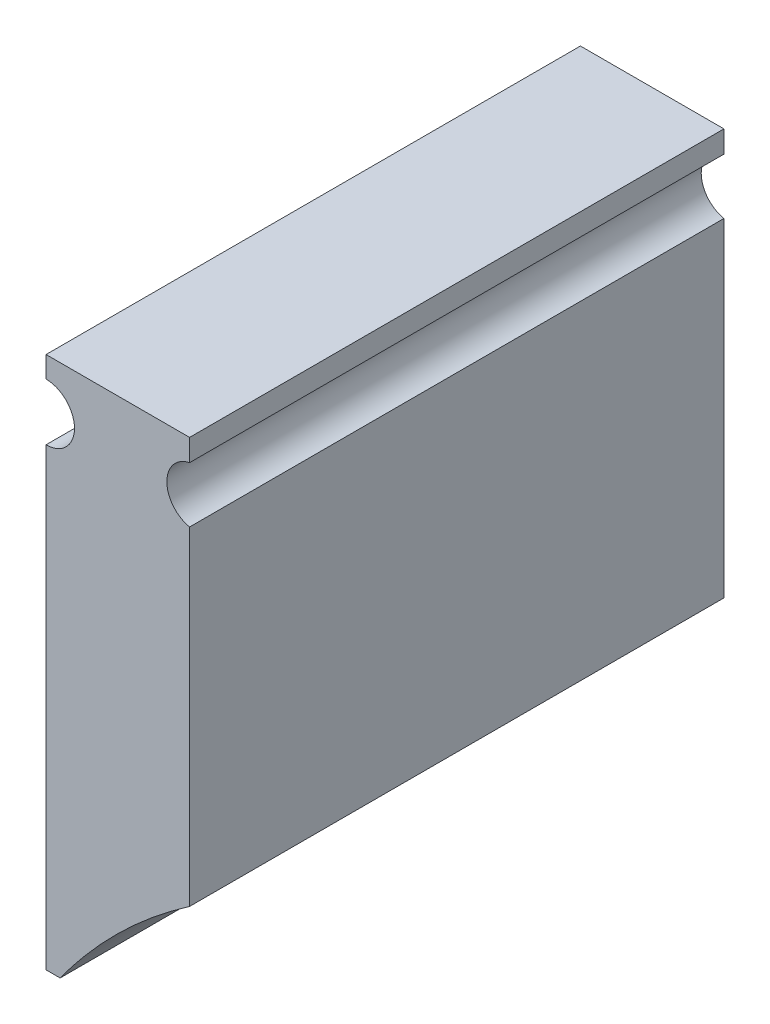
ISO-10303-21;
HEADER;
FILE_DESCRIPTION(('STEP AP214'),'2;1');
FILE_NAME('part.step','',(''),(''),'','','');
FILE_SCHEMA(('AUTOMOTIVE_DESIGN { 1 0 10303 214 1 1 1 1 }'));
ENDSEC;
DATA;
#1=APPLICATION_CONTEXT('core data for automotive mechanical design processes');
#2=APPLICATION_PROTOCOL_DEFINITION('international standard','automotive_design',2000,#1);
#3=PRODUCT_CONTEXT('',#1,'mechanical');
#4=PRODUCT('Part','Part','',(#3));
#5=PRODUCT_RELATED_PRODUCT_CATEGORY('part','',(#4));
#6=PRODUCT_DEFINITION_FORMATION('','',#4);
#7=PRODUCT_DEFINITION_CONTEXT('part definition',#1,'design');
#8=PRODUCT_DEFINITION('design','',#6,#7);
#9=PRODUCT_DEFINITION_SHAPE('','',#8);
#10=(LENGTH_UNIT() NAMED_UNIT(*) SI_UNIT(.MILLI.,.METRE.));
#11=(NAMED_UNIT(*) PLANE_ANGLE_UNIT() SI_UNIT($,.RADIAN.));
#12=(NAMED_UNIT(*) SI_UNIT($,.STERADIAN.) SOLID_ANGLE_UNIT());
#13=UNCERTAINTY_MEASURE_WITH_UNIT(LENGTH_MEASURE(1.E-05),#10,'distance_accuracy_value','');
#14=(GEOMETRIC_REPRESENTATION_CONTEXT(3) GLOBAL_UNCERTAINTY_ASSIGNED_CONTEXT((#13)) GLOBAL_UNIT_ASSIGNED_CONTEXT((#10,
#11,#12)) REPRESENTATION_CONTEXT('',''));
#15=CARTESIAN_POINT('',(0.,0.,0.));
#16=DIRECTION('',(0.,0.,1.));
#17=DIRECTION('',(1.,0.,0.));
#18=AXIS2_PLACEMENT_3D('',#15,#16,#17);
#19=CARTESIAN_POINT('',(2.4638,19.05,-19.304));
#20=DIRECTION('',(-1.,0.,0.));
#21=DIRECTION('',(0.,0.,1.));
#22=AXIS2_PLACEMENT_3D('',#19,#20,#21);
#23=PLANE('',#22);
#24=DIRECTION('',(0.,0.,1.));
#25=VECTOR('',#24,1.);
#26=CARTESIAN_POINT('',(2.4638,16.2765273685329,-19.304));
#27=LINE('',#26,#25);
#28=CARTESIAN_POINT('',(2.4638,16.2765273685329,-0.203199999999997));
#29=VERTEX_POINT('',#28);
#30=CARTESIAN_POINT('',(2.4638,16.2765273685329,-19.304));
#31=VERTEX_POINT('',#30);
#32=EDGE_CURVE('E47',#29,#31,#27,.F.);
#33=ORIENTED_EDGE('',*,*,#32,.F.);
#34=DIRECTION('',(0.,-1.,0.));
#35=VECTOR('',#34,1.);
#36=CARTESIAN_POINT('',(2.4638,19.05,-0.203199999999997));
#37=LINE('',#36,#35);
#38=CARTESIAN_POINT('',(2.4638,4.52925206053652,-0.203199999999997));
#39=VERTEX_POINT('',#38);
#40=EDGE_CURVE('E121',#29,#39,#37,.T.);
#41=ORIENTED_EDGE('',*,*,#40,.T.);
#42=DIRECTION('',(0.,0.,1.));
#43=VECTOR('',#42,1.);
#44=CARTESIAN_POINT('',(2.4638,4.52925206053652,-19.304));
#45=LINE('',#44,#43);
#46=CARTESIAN_POINT('',(2.4638,4.52925206053652,-19.304));
#47=VERTEX_POINT('',#46);
#48=EDGE_CURVE('E157',#47,#39,#45,.T.);
#49=ORIENTED_EDGE('',*,*,#48,.F.);
#50=DIRECTION('',(0.,-1.,0.));
#51=VECTOR('',#50,1.);
#52=CARTESIAN_POINT('',(2.4638,19.05,-19.304));
#53=LINE('',#52,#51);
#54=EDGE_CURVE('E122',#31,#47,#53,.T.);
#55=ORIENTED_EDGE('',*,*,#54,.F.);
#56=EDGE_LOOP('',(#33,#41,#49,#55));
#57=FACE_BOUND('',#56,.T.);
#58=ADVANCED_FACE('F33',(#57),#23,.F.);
#59=DIRECTION('',(0.,0.,1.));
#60=VECTOR('',#59,1.);
#61=CARTESIAN_POINT('',(2.4638,18.2674726314671,-19.304));
#62=LINE('',#61,#60);
#63=CARTESIAN_POINT('',(2.4638,18.2674726314671,-19.304));
#64=VERTEX_POINT('',#63);
#65=CARTESIAN_POINT('',(2.4638,18.2674726314671,-0.203199999999997));
#66=VERTEX_POINT('',#65);
#67=EDGE_CURVE('E102',#64,#66,#62,.T.);
#68=ORIENTED_EDGE('',*,*,#67,.F.);
#69=CARTESIAN_POINT('',(2.4638,19.05,-19.304));
#70=VERTEX_POINT('',#69);
#71=EDGE_CURVE('E112',#70,#64,#53,.T.);
#72=ORIENTED_EDGE('',*,*,#71,.F.);
#73=DIRECTION('',(0.,0.,-1.));
#74=VECTOR('',#73,1.);
#75=CARTESIAN_POINT('',(2.4638,19.05,-19.304));
#76=LINE('',#75,#74);
#77=CARTESIAN_POINT('',(2.4638,19.05,-0.203199999999997));
#78=VERTEX_POINT('',#77);
#79=EDGE_CURVE('E168',#78,#70,#76,.T.);
#80=ORIENTED_EDGE('',*,*,#79,.F.);
#81=EDGE_CURVE('E115',#78,#66,#37,.T.);
#82=ORIENTED_EDGE('',*,*,#81,.T.);
#83=EDGE_LOOP('',(#68,#72,#80,#82));
#84=FACE_BOUND('',#83,.T.);
#85=ADVANCED_FACE('F110',(#84),#23,.F.);
#86=CARTESIAN_POINT('',(-2.667,19.05,-19.304));
#87=DIRECTION('',(1.,0.,0.));
#88=DIRECTION('',(0.,0.,-1.));
#89=AXIS2_PLACEMENT_3D('',#86,#87,#88);
#90=PLANE('',#89);
#91=DIRECTION('',(0.,-1.,0.));
#92=VECTOR('',#91,1.);
#93=CARTESIAN_POINT('',(-2.667,19.05,-19.304));
#94=LINE('',#93,#92);
#95=CARTESIAN_POINT('',(-2.667,19.05,-19.304));
#96=VERTEX_POINT('',#95);
#97=CARTESIAN_POINT('',(-2.667,18.288,-19.304));
#98=VERTEX_POINT('',#97);
#99=EDGE_CURVE('E125',#96,#98,#94,.T.);
#100=ORIENTED_EDGE('',*,*,#99,.T.);
#101=DIRECTION('',(0.,0.,1.));
#102=VECTOR('',#101,1.);
#103=CARTESIAN_POINT('',(-2.667,18.288,-19.304));
#104=LINE('',#103,#102);
#105=CARTESIAN_POINT('',(-2.667,18.288,-0.203199999999997));
#106=VERTEX_POINT('',#105);
#107=EDGE_CURVE('E55',#98,#106,#104,.T.);
#108=ORIENTED_EDGE('',*,*,#107,.T.);
#109=DIRECTION('',(0.,-1.,0.));
#110=VECTOR('',#109,1.);
#111=CARTESIAN_POINT('',(-2.667,19.05,-0.203199999999997));
#112=LINE('',#111,#110);
#113=CARTESIAN_POINT('',(-2.667,19.05,-0.203199999999997));
#114=VERTEX_POINT('',#113);
#115=EDGE_CURVE('E41',#114,#106,#112,.T.);
#116=ORIENTED_EDGE('',*,*,#115,.F.);
#117=DIRECTION('',(0.,0.,1.));
#118=VECTOR('',#117,1.);
#119=CARTESIAN_POINT('',(-2.667,19.05,-19.304));
#120=LINE('',#119,#118);
#121=EDGE_CURVE('E161',#96,#114,#120,.T.);
#122=ORIENTED_EDGE('',*,*,#121,.F.);
#123=EDGE_LOOP('',(#100,#108,#116,#122));
#124=FACE_BOUND('',#123,.T.);
#125=ADVANCED_FACE('F175',(#124),#90,.F.);
#126=CARTESIAN_POINT('',(-2.667,16.256,-0.203199999999997));
#127=VERTEX_POINT('',#126);
#128=CARTESIAN_POINT('',(-2.667,0.,-0.203199999999997));
#129=VERTEX_POINT('',#128);
#130=EDGE_CURVE('E128',#127,#129,#112,.T.);
#131=ORIENTED_EDGE('',*,*,#130,.F.);
#132=DIRECTION('',(0.,0.,1.));
#133=VECTOR('',#132,1.);
#134=CARTESIAN_POINT('',(-2.667,16.256,-19.304));
#135=LINE('',#134,#133);
#136=CARTESIAN_POINT('',(-2.667,16.256,-19.304));
#137=VERTEX_POINT('',#136);
#138=EDGE_CURVE('E178',#137,#127,#135,.T.);
#139=ORIENTED_EDGE('',*,*,#138,.F.);
#140=CARTESIAN_POINT('',(-2.667,0.,-19.304));
#141=VERTEX_POINT('',#140);
#142=EDGE_CURVE('E153',#137,#141,#94,.T.);
#143=ORIENTED_EDGE('',*,*,#142,.T.);
#144=DIRECTION('',(0.,0.,1.));
#145=VECTOR('',#144,1.);
#146=CARTESIAN_POINT('',(-2.667,0.,-19.304));
#147=LINE('',#146,#145);
#148=EDGE_CURVE('E148',#141,#129,#147,.T.);
#149=ORIENTED_EDGE('',*,*,#148,.T.);
#150=EDGE_LOOP('',(#131,#139,#143,#149));
#151=FACE_BOUND('',#150,.T.);
#152=ADVANCED_FACE('F35',(#151),#90,.F.);
#153=CARTESIAN_POINT('',(-2.667,19.05,-0.203199999999997));
#154=DIRECTION('',(0.,0.,-1.));
#155=DIRECTION('',(-1.,0.,0.));
#156=AXIS2_PLACEMENT_3D('',#153,#154,#155);
#157=PLANE('',#156);
#158=CARTESIAN_POINT('',(2.667,17.272,-0.203199999999997));
#159=DIRECTION('',(0.,0.,-1.));
#160=DIRECTION('',(-1.,0.,0.));
#161=AXIS2_PLACEMENT_3D('',#158,#159,#160);
#162=CIRCLE('',#161,1.016);
#163=EDGE_CURVE('E116',#66,#29,#162,.F.);
#164=ORIENTED_EDGE('',*,*,#163,.F.);
#165=ORIENTED_EDGE('',*,*,#81,.F.);
#166=DIRECTION('',(1.,0.,0.));
#167=VECTOR('',#166,1.);
#168=CARTESIAN_POINT('',(-2.667,19.05,-0.203199999999997));
#169=LINE('',#168,#167);
#170=EDGE_CURVE('E164',#114,#78,#169,.T.);
#171=ORIENTED_EDGE('',*,*,#170,.F.);
#172=ORIENTED_EDGE('',*,*,#115,.T.);
#173=CARTESIAN_POINT('',(-2.667,17.272,-0.203199999999997));
#174=DIRECTION('',(0.,0.,-1.));
#175=DIRECTION('',(-1.,0.,0.));
#176=AXIS2_PLACEMENT_3D('',#173,#174,#175);
#177=CIRCLE('',#176,1.016);
#178=EDGE_CURVE('E139',#106,#127,#177,.T.);
#179=ORIENTED_EDGE('',*,*,#178,.T.);
#180=ORIENTED_EDGE('',*,*,#130,.T.);
#181=DIRECTION('',(1.,0.,0.));
#182=VECTOR('',#181,1.);
#183=CARTESIAN_POINT('',(-2.667,0.,-0.203199999999997));
#184=LINE('',#183,#182);
#185=CARTESIAN_POINT('',(-2.16420531257216,0.,-0.203199999999997));
#186=VERTEX_POINT('',#185);
#187=EDGE_CURVE('E138',#129,#186,#184,.T.);
#188=ORIENTED_EDGE('',*,*,#187,.T.);
#189=CARTESIAN_POINT('',(2.4638,4.52925206053652,-0.203199999999997));
#190=CARTESIAN_POINT('',(-0.235595224669027,2.66307700172279,-0.203199999999997));
#191=CARTESIAN_POINT('',(-2.16420531257216,0.,-0.203199999999997));
#192=B_SPLINE_CURVE_WITH_KNOTS('',2,(#189,#190,#191),.UNSPECIFIED.,.F.,.F.,(3,3),(0.,1.),.UNSPECIFIED.);
#193=EDGE_CURVE('E155',#186,#39,#192,.F.);
#194=ORIENTED_EDGE('',*,*,#193,.T.);
#195=ORIENTED_EDGE('',*,*,#40,.F.);
#196=EDGE_LOOP('',(#164,#165,#171,#172,#179,#180,#188,#194,#195));
#197=FACE_BOUND('',#196,.T.);
#198=ADVANCED_FACE('F136',(#197),#157,.F.);
#199=CARTESIAN_POINT('',(-2.667,19.05,-19.304));
#200=DIRECTION('',(0.,0.,1.));
#201=DIRECTION('',(1.,0.,0.));
#202=AXIS2_PLACEMENT_3D('',#199,#200,#201);
#203=PLANE('',#202);
#204=CARTESIAN_POINT('',(2.667,17.272,-19.304));
#205=DIRECTION('',(0.,0.,1.));
#206=DIRECTION('',(1.,0.,0.));
#207=AXIS2_PLACEMENT_3D('',#204,#205,#206);
#208=CIRCLE('',#207,1.016);
#209=EDGE_CURVE('E11',#31,#64,#208,.F.);
#210=ORIENTED_EDGE('',*,*,#209,.F.);
#211=ORIENTED_EDGE('',*,*,#54,.T.);
#212=CARTESIAN_POINT('',(2.4638,4.52925206053652,-19.304));
#213=CARTESIAN_POINT('',(-0.235595224669027,2.66307700172279,-19.304));
#214=CARTESIAN_POINT('',(-2.16420531257216,0.,-19.304));
#215=B_SPLINE_CURVE_WITH_KNOTS('',2,(#212,#213,#214),.UNSPECIFIED.,.F.,.F.,(3,3),(0.,1.),.UNSPECIFIED.);
#216=CARTESIAN_POINT('',(-2.16420531257216,0.,-19.304));
#217=VERTEX_POINT('',#216);
#218=EDGE_CURVE('E185',#47,#217,#215,.T.);
#219=ORIENTED_EDGE('',*,*,#218,.T.);
#220=DIRECTION('',(-1.,0.,0.));
#221=VECTOR('',#220,1.);
#222=CARTESIAN_POINT('',(-2.667,0.,-19.304));
#223=LINE('',#222,#221);
#224=EDGE_CURVE('E150',#217,#141,#223,.T.);
#225=ORIENTED_EDGE('',*,*,#224,.T.);
#226=ORIENTED_EDGE('',*,*,#142,.F.);
#227=CARTESIAN_POINT('',(-2.667,17.272,-19.304));
#228=DIRECTION('',(0.,0.,1.));
#229=DIRECTION('',(-1.,0.,0.));
#230=AXIS2_PLACEMENT_3D('',#227,#228,#229);
#231=CIRCLE('',#230,1.016);
#232=EDGE_CURVE('E176',#137,#98,#231,.T.);
#233=ORIENTED_EDGE('',*,*,#232,.T.);
#234=ORIENTED_EDGE('',*,*,#99,.F.);
#235=DIRECTION('',(-1.,0.,0.));
#236=VECTOR('',#235,1.);
#237=CARTESIAN_POINT('',(-2.667,19.05,-19.304));
#238=LINE('',#237,#236);
#239=EDGE_CURVE('E120',#70,#96,#238,.T.);
#240=ORIENTED_EDGE('',*,*,#239,.F.);
#241=ORIENTED_EDGE('',*,*,#71,.T.);
#242=EDGE_LOOP('',(#210,#211,#219,#225,#226,#233,#234,#240,#241));
#243=FACE_BOUND('',#242,.T.);
#244=ADVANCED_FACE('F118',(#243),#203,.F.);
#245=CARTESIAN_POINT('',(0.,19.05,0.));
#246=DIRECTION('',(0.,1.,0.));
#247=DIRECTION('',(0.,0.,1.));
#248=AXIS2_PLACEMENT_3D('',#245,#246,#247);
#249=PLANE('',#248);
#250=ORIENTED_EDGE('',*,*,#121,.T.);
#251=ORIENTED_EDGE('',*,*,#170,.T.);
#252=ORIENTED_EDGE('',*,*,#79,.T.);
#253=ORIENTED_EDGE('',*,*,#239,.T.);
#254=EDGE_LOOP('',(#250,#251,#252,#253));
#255=FACE_BOUND('',#254,.T.);
#256=ADVANCED_FACE('F201',(#255),#249,.T.);
#257=CARTESIAN_POINT('',(0.,0.,0.));
#258=DIRECTION('',(0.,1.,0.));
#259=DIRECTION('',(0.,0.,1.));
#260=AXIS2_PLACEMENT_3D('',#257,#258,#259);
#261=PLANE('',#260);
#262=ORIENTED_EDGE('',*,*,#224,.F.);
#263=DIRECTION('',(0.,0.,1.));
#264=VECTOR('',#263,1.);
#265=CARTESIAN_POINT('',(-2.16420531257216,0.,-19.304));
#266=LINE('',#265,#264);
#267=EDGE_CURVE('E149',#217,#186,#266,.T.);
#268=ORIENTED_EDGE('',*,*,#267,.T.);
#269=ORIENTED_EDGE('',*,*,#187,.F.);
#270=ORIENTED_EDGE('',*,*,#148,.F.);
#271=EDGE_LOOP('',(#262,#268,#269,#270));
#272=FACE_BOUND('',#271,.T.);
#273=ADVANCED_FACE('F147',(#272),#261,.F.);
#274=DIRECTION('',(0.,0.,1.));
#275=VECTOR('',#274,1.);
#276=SURFACE_OF_LINEAR_EXTRUSION('',#215,#275);
#277=ORIENTED_EDGE('',*,*,#267,.F.);
#278=ORIENTED_EDGE('',*,*,#218,.F.);
#279=ORIENTED_EDGE('',*,*,#48,.T.);
#280=ORIENTED_EDGE('',*,*,#193,.F.);
#281=EDGE_LOOP('',(#277,#278,#279,#280));
#282=FACE_BOUND('',#281,.T.);
#283=ADVANCED_FACE('F194',(#282),#276,.F.);
#284=CARTESIAN_POINT('',(-2.667,17.272,-19.304));
#285=DIRECTION('',(0.,0.,1.));
#286=DIRECTION('',(1.,0.,0.));
#287=AXIS2_PLACEMENT_3D('',#284,#285,#286);
#288=CYLINDRICAL_SURFACE('',#287,1.016);
#289=ORIENTED_EDGE('',*,*,#107,.F.);
#290=ORIENTED_EDGE('',*,*,#232,.F.);
#291=ORIENTED_EDGE('',*,*,#138,.T.);
#292=ORIENTED_EDGE('',*,*,#178,.F.);
#293=EDGE_LOOP('',(#289,#290,#291,#292));
#294=FACE_BOUND('',#293,.T.);
#295=ADVANCED_FACE('F198',(#294),#288,.F.);
#296=CARTESIAN_POINT('',(2.667,17.272,-19.304));
#297=DIRECTION('',(0.,0.,1.));
#298=DIRECTION('',(1.,0.,0.));
#299=AXIS2_PLACEMENT_3D('',#296,#297,#298);
#300=CYLINDRICAL_SURFACE('',#299,1.016);
#301=ORIENTED_EDGE('',*,*,#32,.T.);
#302=ORIENTED_EDGE('',*,*,#209,.T.);
#303=ORIENTED_EDGE('',*,*,#67,.T.);
#304=ORIENTED_EDGE('',*,*,#163,.T.);
#305=EDGE_LOOP('',(#301,#302,#303,#304));
#306=FACE_BOUND('',#305,.T.);
#307=ADVANCED_FACE('F101',(#306),#300,.F.);
#308=CLOSED_SHELL('',(#58,#85,#125,#152,#198,#244,#256,#273,#283,#295,#307));
#309=MANIFOLD_SOLID_BREP('B2',#308);
#310=ADVANCED_BREP_SHAPE_REPRESENTATION('',(#18,#309),#14);
#311=SHAPE_DEFINITION_REPRESENTATION(#9,#310);
ENDSEC;
END-ISO-10303-21;
